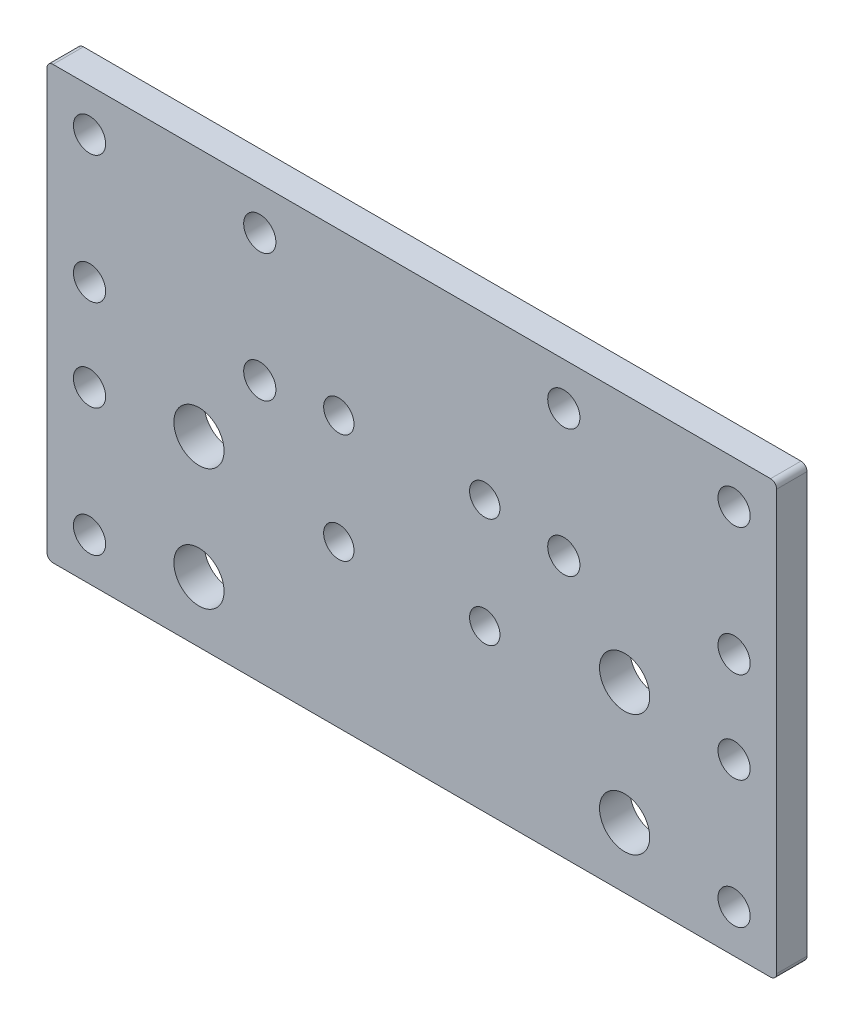
ISO-10303-21;
HEADER;
FILE_DESCRIPTION(('STEP AP214'),'2;1');
FILE_NAME('part.step','',(''),(''),'','','');
FILE_SCHEMA(('AUTOMOTIVE_DESIGN { 1 0 10303 214 1 1 1 1 }'));
ENDSEC;
DATA;
#1=APPLICATION_CONTEXT('core data for automotive mechanical design processes');
#2=APPLICATION_PROTOCOL_DEFINITION('international standard','automotive_design',2000,#1);
#3=PRODUCT_CONTEXT('',#1,'mechanical');
#4=PRODUCT('Part','Part','',(#3));
#5=PRODUCT_RELATED_PRODUCT_CATEGORY('part','',(#4));
#6=PRODUCT_DEFINITION_FORMATION('','',#4);
#7=PRODUCT_DEFINITION_CONTEXT('part definition',#1,'design');
#8=PRODUCT_DEFINITION('design','',#6,#7);
#9=PRODUCT_DEFINITION_SHAPE('','',#8);
#10=(LENGTH_UNIT() NAMED_UNIT(*) SI_UNIT(.MILLI.,.METRE.));
#11=(NAMED_UNIT(*) PLANE_ANGLE_UNIT() SI_UNIT($,.RADIAN.));
#12=(NAMED_UNIT(*) SI_UNIT($,.STERADIAN.) SOLID_ANGLE_UNIT());
#13=UNCERTAINTY_MEASURE_WITH_UNIT(LENGTH_MEASURE(1.E-05),#10,'distance_accuracy_value','');
#14=(GEOMETRIC_REPRESENTATION_CONTEXT(3) GLOBAL_UNCERTAINTY_ASSIGNED_CONTEXT((#13)) GLOBAL_UNIT_ASSIGNED_CONTEXT((#10,
#11,#12)) REPRESENTATION_CONTEXT('',''));
#15=CARTESIAN_POINT('',(0.,0.,0.));
#16=DIRECTION('',(0.,0.,1.));
#17=DIRECTION('',(1.,0.,0.));
#18=AXIS2_PLACEMENT_3D('',#15,#16,#17);
#19=CARTESIAN_POINT('',(0.,0.,5.));
#20=DIRECTION('',(0.,0.,-1.));
#21=DIRECTION('',(-1.,0.,0.));
#22=AXIS2_PLACEMENT_3D('',#19,#20,#21);
#23=PLANE('',#22);
#24=CARTESIAN_POINT('',(113.000000000018,7.00000000000894,5.));
#25=DIRECTION('',(0.,0.,-1.));
#26=DIRECTION('',(-1.,0.,0.));
#27=AXIS2_PLACEMENT_3D('',#24,#25,#26);
#28=CIRCLE('',#27,2.65000000001325);
#29=CARTESIAN_POINT('',(110.350000000005,7.00000000000894,5.));
#30=VERTEX_POINT('',#29);
#31=EDGE_CURVE('E233',#30,#30,#28,.T.);
#32=ORIENTED_EDGE('',*,*,#31,.T.);
#33=EDGE_LOOP('',(#32));
#34=FACE_BOUND('',#33,.T.);
#35=CARTESIAN_POINT('',(24.9999999999999,10.0000000000001,5.));
#36=DIRECTION('',(0.,0.,-1.));
#37=DIRECTION('',(-1.,0.,0.));
#38=AXIS2_PLACEMENT_3D('',#35,#36,#37);
#39=CIRCLE('',#38,4.1275);
#40=CARTESIAN_POINT('',(20.8724999999999,10.0000000000001,5.));
#41=VERTEX_POINT('',#40);
#42=EDGE_CURVE('E221',#41,#41,#39,.T.);
#43=ORIENTED_EDGE('',*,*,#42,.T.);
#44=EDGE_LOOP('',(#43));
#45=FACE_BOUND('',#44,.T.);
#46=CARTESIAN_POINT('',(113.000000000018,28.0000000000089,5.));
#47=DIRECTION('',(0.,0.,-1.));
#48=DIRECTION('',(-1.,0.,0.));
#49=AXIS2_PLACEMENT_3D('',#46,#47,#48);
#50=CIRCLE('',#49,2.65000000001325);
#51=CARTESIAN_POINT('',(110.350000000005,28.0000000000089,5.));
#52=VERTEX_POINT('',#51);
#53=EDGE_CURVE('E218',#52,#52,#50,.T.);
#54=ORIENTED_EDGE('',*,*,#53,.T.);
#55=EDGE_LOOP('',(#54));
#56=FACE_BOUND('',#55,.T.);
#57=CARTESIAN_POINT('',(85.0000000000015,43.0000000000007,5.));
#58=DIRECTION('',(0.,0.,-1.));
#59=DIRECTION('',(-1.,0.,0.));
#60=AXIS2_PLACEMENT_3D('',#57,#58,#59);
#61=CIRCLE('',#60,2.65);
#62=CARTESIAN_POINT('',(82.3500000000015,43.0000000000007,5.));
#63=VERTEX_POINT('',#62);
#64=EDGE_CURVE('E215',#63,#63,#61,.T.);
#65=ORIENTED_EDGE('',*,*,#64,.T.);
#66=EDGE_LOOP('',(#65));
#67=FACE_BOUND('',#66,.T.);
#68=CARTESIAN_POINT('',(24.9999999999998,30.,5.));
#69=DIRECTION('',(0.,0.,-1.));
#70=DIRECTION('',(-1.,0.,0.));
#71=AXIS2_PLACEMENT_3D('',#68,#69,#70);
#72=CIRCLE('',#71,4.12749999999999);
#73=CARTESIAN_POINT('',(20.8724999999998,30.,5.));
#74=VERTEX_POINT('',#73);
#75=EDGE_CURVE('E211',#74,#74,#72,.T.);
#76=ORIENTED_EDGE('',*,*,#75,.T.);
#77=EDGE_LOOP('',(#76));
#78=FACE_BOUND('',#77,.T.);
#79=CARTESIAN_POINT('',(35.,43.,5.));
#80=DIRECTION('',(0.,0.,-1.));
#81=DIRECTION('',(-1.,0.,0.));
#82=AXIS2_PLACEMENT_3D('',#79,#80,#81);
#83=CIRCLE('',#82,2.65);
#84=CARTESIAN_POINT('',(32.35,43.,5.));
#85=VERTEX_POINT('',#84);
#86=EDGE_CURVE('E207',#85,#85,#83,.T.);
#87=ORIENTED_EDGE('',*,*,#86,.T.);
#88=EDGE_LOOP('',(#87));
#89=FACE_BOUND('',#88,.T.);
#90=CARTESIAN_POINT('',(85.0000000000179,64.0000000000089,5.));
#91=DIRECTION('',(0.,0.,-1.));
#92=DIRECTION('',(-1.,0.,0.));
#93=AXIS2_PLACEMENT_3D('',#90,#91,#92);
#94=CIRCLE('',#93,2.65000000001322);
#95=CARTESIAN_POINT('',(82.3500000000047,64.0000000000089,5.));
#96=VERTEX_POINT('',#95);
#97=EDGE_CURVE('E203',#96,#96,#94,.T.);
#98=ORIENTED_EDGE('',*,*,#97,.T.);
#99=EDGE_LOOP('',(#98));
#100=FACE_BOUND('',#99,.T.);
#101=CARTESIAN_POINT('',(113.000000000018,43.0000000000089,5.));
#102=DIRECTION('',(0.,0.,-1.));
#103=DIRECTION('',(-1.,0.,0.));
#104=AXIS2_PLACEMENT_3D('',#101,#102,#103);
#105=CIRCLE('',#104,2.65000000001323);
#106=CARTESIAN_POINT('',(110.350000000005,43.0000000000089,5.));
#107=VERTEX_POINT('',#106);
#108=EDGE_CURVE('E199',#107,#107,#105,.T.);
#109=ORIENTED_EDGE('',*,*,#108,.T.);
#110=EDGE_LOOP('',(#109));
#111=FACE_BOUND('',#110,.T.);
#112=CARTESIAN_POINT('',(7.00000000000002,7.00000000000003,5.));
#113=DIRECTION('',(0.,0.,-1.));
#114=DIRECTION('',(-1.,0.,0.));
#115=AXIS2_PLACEMENT_3D('',#112,#113,#114);
#116=CIRCLE('',#115,2.65);
#117=CARTESIAN_POINT('',(4.35000000000002,7.00000000000003,5.));
#118=VERTEX_POINT('',#117);
#119=EDGE_CURVE('E195',#118,#118,#116,.T.);
#120=ORIENTED_EDGE('',*,*,#119,.T.);
#121=EDGE_LOOP('',(#120));
#122=FACE_BOUND('',#121,.T.);
#123=CARTESIAN_POINT('',(94.9999999999999,10.,5.));
#124=DIRECTION('',(0.,0.,-1.));
#125=DIRECTION('',(-1.,0.,0.));
#126=AXIS2_PLACEMENT_3D('',#123,#124,#125);
#127=CIRCLE('',#126,4.12749999999999);
#128=CARTESIAN_POINT('',(90.8724999999999,10.,5.));
#129=VERTEX_POINT('',#128);
#130=EDGE_CURVE('E191',#129,#129,#127,.T.);
#131=ORIENTED_EDGE('',*,*,#130,.T.);
#132=EDGE_LOOP('',(#131));
#133=FACE_BOUND('',#132,.T.);
#134=CARTESIAN_POINT('',(94.9999999999999,30.,5.));
#135=DIRECTION('',(0.,0.,-1.));
#136=DIRECTION('',(-1.,0.,0.));
#137=AXIS2_PLACEMENT_3D('',#134,#135,#136);
#138=CIRCLE('',#137,4.12749999999999);
#139=CARTESIAN_POINT('',(90.8725,30.,5.));
#140=VERTEX_POINT('',#139);
#141=EDGE_CURVE('E187',#140,#140,#138,.T.);
#142=ORIENTED_EDGE('',*,*,#141,.T.);
#143=EDGE_LOOP('',(#142));
#144=FACE_BOUND('',#143,.T.);
#145=CARTESIAN_POINT('',(7.00000000000002,28.,5.));
#146=DIRECTION('',(0.,0.,-1.));
#147=DIRECTION('',(-1.,0.,0.));
#148=AXIS2_PLACEMENT_3D('',#145,#146,#147);
#149=CIRCLE('',#148,2.65);
#150=CARTESIAN_POINT('',(4.35000000000002,28.,5.));
#151=VERTEX_POINT('',#150);
#152=EDGE_CURVE('E183',#151,#151,#149,.T.);
#153=ORIENTED_EDGE('',*,*,#152,.T.);
#154=EDGE_LOOP('',(#153));
#155=FACE_BOUND('',#154,.T.);
#156=CARTESIAN_POINT('',(7.00000000000002,64.,5.));
#157=DIRECTION('',(0.,0.,-1.));
#158=DIRECTION('',(-1.,0.,0.));
#159=AXIS2_PLACEMENT_3D('',#156,#157,#158);
#160=CIRCLE('',#159,2.65);
#161=CARTESIAN_POINT('',(4.35000000000002,64.,5.));
#162=VERTEX_POINT('',#161);
#163=EDGE_CURVE('E179',#162,#162,#160,.T.);
#164=ORIENTED_EDGE('',*,*,#163,.T.);
#165=EDGE_LOOP('',(#164));
#166=FACE_BOUND('',#165,.T.);
#167=CARTESIAN_POINT('',(7.00000000000002,43.,5.));
#168=DIRECTION('',(0.,0.,-1.));
#169=DIRECTION('',(-1.,0.,0.));
#170=AXIS2_PLACEMENT_3D('',#167,#168,#169);
#171=CIRCLE('',#170,2.65);
#172=CARTESIAN_POINT('',(4.35000000000002,43.,5.));
#173=VERTEX_POINT('',#172);
#174=EDGE_CURVE('E175',#173,#173,#171,.T.);
#175=ORIENTED_EDGE('',*,*,#174,.T.);
#176=EDGE_LOOP('',(#175));
#177=FACE_BOUND('',#176,.T.);
#178=CARTESIAN_POINT('',(35.,64.,5.));
#179=DIRECTION('',(0.,0.,-1.));
#180=DIRECTION('',(-1.,0.,0.));
#181=AXIS2_PLACEMENT_3D('',#178,#179,#180);
#182=CIRCLE('',#181,2.65);
#183=CARTESIAN_POINT('',(32.35,64.,5.));
#184=VERTEX_POINT('',#183);
#185=EDGE_CURVE('E171',#184,#184,#182,.T.);
#186=ORIENTED_EDGE('',*,*,#185,.T.);
#187=EDGE_LOOP('',(#186));
#188=FACE_BOUND('',#187,.T.);
#189=CARTESIAN_POINT('',(113.000000000018,64.0000000000089,5.));
#190=DIRECTION('',(0.,0.,-1.));
#191=DIRECTION('',(-1.,0.,0.));
#192=AXIS2_PLACEMENT_3D('',#189,#190,#191);
#193=CIRCLE('',#192,2.65000000001322);
#194=CARTESIAN_POINT('',(110.350000000005,64.0000000000089,5.));
#195=VERTEX_POINT('',#194);
#196=EDGE_CURVE('E167',#195,#195,#193,.T.);
#197=ORIENTED_EDGE('',*,*,#196,.T.);
#198=EDGE_LOOP('',(#197));
#199=FACE_BOUND('',#198,.T.);
#200=DIRECTION('',(0.,-1.,0.));
#201=VECTOR('',#200,1.);
#202=CARTESIAN_POINT('',(0.,0.,5.));
#203=LINE('',#202,#201);
#204=CARTESIAN_POINT('',(0.,70.,5.));
#205=VERTEX_POINT('',#204);
#206=CARTESIAN_POINT('',(0.,1.,5.));
#207=VERTEX_POINT('',#206);
#208=EDGE_CURVE('E141',#205,#207,#203,.T.);
#209=ORIENTED_EDGE('',*,*,#208,.T.);
#210=CARTESIAN_POINT('',(1.,1.,5.));
#211=DIRECTION('',(0.,0.,-1.));
#212=DIRECTION('',(-1.,0.,0.));
#213=AXIS2_PLACEMENT_3D('',#210,#211,#212);
#214=CIRCLE('',#213,1.);
#215=CARTESIAN_POINT('',(1.,0.,5.));
#216=VERTEX_POINT('',#215);
#217=EDGE_CURVE('E156',#207,#216,#214,.F.);
#218=ORIENTED_EDGE('',*,*,#217,.T.);
#219=DIRECTION('',(1.,0.,0.));
#220=VECTOR('',#219,1.);
#221=CARTESIAN_POINT('',(0.,0.,5.));
#222=LINE('',#221,#220);
#223=CARTESIAN_POINT('',(119.,0.,5.));
#224=VERTEX_POINT('',#223);
#225=EDGE_CURVE('E123',#216,#224,#222,.T.);
#226=ORIENTED_EDGE('',*,*,#225,.T.);
#227=CARTESIAN_POINT('',(119.,1.,5.));
#228=DIRECTION('',(0.,0.,-1.));
#229=DIRECTION('',(-1.,0.,0.));
#230=AXIS2_PLACEMENT_3D('',#227,#228,#229);
#231=CIRCLE('',#230,1.);
#232=CARTESIAN_POINT('',(120.,1.,5.));
#233=VERTEX_POINT('',#232);
#234=EDGE_CURVE('E154',#224,#233,#231,.F.);
#235=ORIENTED_EDGE('',*,*,#234,.T.);
#236=DIRECTION('',(0.,1.,0.));
#237=VECTOR('',#236,1.);
#238=CARTESIAN_POINT('',(120.,0.,5.));
#239=LINE('',#238,#237);
#240=CARTESIAN_POINT('',(120.,70.,5.));
#241=VERTEX_POINT('',#240);
#242=EDGE_CURVE('E262',#233,#241,#239,.T.);
#243=ORIENTED_EDGE('',*,*,#242,.T.);
#244=CARTESIAN_POINT('',(119.,70.,5.));
#245=DIRECTION('',(0.,0.,-1.));
#246=DIRECTION('',(-1.,0.,0.));
#247=AXIS2_PLACEMENT_3D('',#244,#245,#246);
#248=CIRCLE('',#247,1.);
#249=CARTESIAN_POINT('',(119.,71.,5.));
#250=VERTEX_POINT('',#249);
#251=EDGE_CURVE('E58',#241,#250,#248,.F.);
#252=ORIENTED_EDGE('',*,*,#251,.T.);
#253=DIRECTION('',(-1.,0.,0.));
#254=VECTOR('',#253,1.);
#255=CARTESIAN_POINT('',(0.,71.,5.));
#256=LINE('',#255,#254);
#257=CARTESIAN_POINT('',(1.,71.,5.));
#258=VERTEX_POINT('',#257);
#259=EDGE_CURVE('E142',#250,#258,#256,.T.);
#260=ORIENTED_EDGE('',*,*,#259,.T.);
#261=CARTESIAN_POINT('',(1.,70.,5.));
#262=DIRECTION('',(0.,0.,-1.));
#263=DIRECTION('',(-1.,0.,0.));
#264=AXIS2_PLACEMENT_3D('',#261,#262,#263);
#265=CIRCLE('',#264,1.);
#266=EDGE_CURVE('E151',#258,#205,#265,.F.);
#267=ORIENTED_EDGE('',*,*,#266,.T.);
#268=EDGE_LOOP('',(#209,#218,#226,#235,#243,#252,#260,#267));
#269=FACE_BOUND('',#268,.T.);
#270=CARTESIAN_POINT('',(48.,44.5,5.));
#271=DIRECTION('',(0.,0.,1.));
#272=DIRECTION('',(1.,0.,0.));
#273=AXIS2_PLACEMENT_3D('',#270,#271,#272);
#274=CIRCLE('',#273,2.5);
#275=CARTESIAN_POINT('',(50.5,44.5,5.));
#276=VERTEX_POINT('',#275);
#277=EDGE_CURVE('E136',#276,#276,#274,.T.);
#278=ORIENTED_EDGE('',*,*,#277,.F.);
#279=EDGE_LOOP('',(#278));
#280=FACE_BOUND('',#279,.T.);
#281=CARTESIAN_POINT('',(72.,44.5,5.));
#282=DIRECTION('',(0.,0.,1.));
#283=DIRECTION('',(1.,0.,0.));
#284=AXIS2_PLACEMENT_3D('',#281,#282,#283);
#285=CIRCLE('',#284,2.5);
#286=CARTESIAN_POINT('',(74.5,44.5,5.));
#287=VERTEX_POINT('',#286);
#288=EDGE_CURVE('E249',#287,#287,#285,.T.);
#289=ORIENTED_EDGE('',*,*,#288,.F.);
#290=EDGE_LOOP('',(#289));
#291=FACE_BOUND('',#290,.T.);
#292=CARTESIAN_POINT('',(48.,26.5,5.));
#293=DIRECTION('',(0.,0.,1.));
#294=DIRECTION('',(1.,0.,0.));
#295=AXIS2_PLACEMENT_3D('',#292,#293,#294);
#296=CIRCLE('',#295,2.5);
#297=CARTESIAN_POINT('',(50.5,26.5,5.));
#298=VERTEX_POINT('',#297);
#299=EDGE_CURVE('E243',#298,#298,#296,.T.);
#300=ORIENTED_EDGE('',*,*,#299,.F.);
#301=EDGE_LOOP('',(#300));
#302=FACE_BOUND('',#301,.T.);
#303=CARTESIAN_POINT('',(72.,26.5,5.));
#304=DIRECTION('',(0.,0.,1.));
#305=DIRECTION('',(1.,0.,0.));
#306=AXIS2_PLACEMENT_3D('',#303,#304,#305);
#307=CIRCLE('',#306,2.49999999999999);
#308=CARTESIAN_POINT('',(74.5,26.5,5.));
#309=VERTEX_POINT('',#308);
#310=EDGE_CURVE('E237',#309,#309,#307,.T.);
#311=ORIENTED_EDGE('',*,*,#310,.F.);
#312=EDGE_LOOP('',(#311));
#313=FACE_BOUND('',#312,.T.);
#314=ADVANCED_FACE('F35',(#34,#45,#56,#67,#78,#89,#100,#111,#122,#133,#144,#155,#166,#177,#188,
#199,#269,#280,#291,#302,#313),#23,.F.);
#315=CARTESIAN_POINT('',(0.,0.,0.));
#316=DIRECTION('',(0.,0.,-1.));
#317=DIRECTION('',(-1.,0.,0.));
#318=AXIS2_PLACEMENT_3D('',#315,#316,#317);
#319=PLANE('',#318);
#320=CARTESIAN_POINT('',(113.000000000018,7.00000000000894,0.));
#321=DIRECTION('',(0.,0.,-1.));
#322=DIRECTION('',(-1.,0.,0.));
#323=AXIS2_PLACEMENT_3D('',#320,#321,#322);
#324=CIRCLE('',#323,2.65000000001325);
#325=CARTESIAN_POINT('',(110.350000000005,7.00000000000894,0.));
#326=VERTEX_POINT('',#325);
#327=EDGE_CURVE('E39',#326,#326,#324,.T.);
#328=ORIENTED_EDGE('',*,*,#327,.F.);
#329=EDGE_LOOP('',(#328));
#330=FACE_BOUND('',#329,.T.);
#331=CARTESIAN_POINT('',(24.9999999999999,10.0000000000001,0.));
#332=DIRECTION('',(0.,0.,-1.));
#333=DIRECTION('',(-1.,0.,0.));
#334=AXIS2_PLACEMENT_3D('',#331,#332,#333);
#335=CIRCLE('',#334,4.1275);
#336=CARTESIAN_POINT('',(20.8724999999999,10.0000000000001,0.));
#337=VERTEX_POINT('',#336);
#338=EDGE_CURVE('E219',#337,#337,#335,.T.);
#339=ORIENTED_EDGE('',*,*,#338,.F.);
#340=EDGE_LOOP('',(#339));
#341=FACE_BOUND('',#340,.T.);
#342=CARTESIAN_POINT('',(113.000000000018,28.0000000000089,0.));
#343=DIRECTION('',(0.,0.,-1.));
#344=DIRECTION('',(-1.,0.,0.));
#345=AXIS2_PLACEMENT_3D('',#342,#343,#344);
#346=CIRCLE('',#345,2.65000000001325);
#347=CARTESIAN_POINT('',(110.350000000005,28.0000000000089,0.));
#348=VERTEX_POINT('',#347);
#349=EDGE_CURVE('E216',#348,#348,#346,.T.);
#350=ORIENTED_EDGE('',*,*,#349,.F.);
#351=EDGE_LOOP('',(#350));
#352=FACE_BOUND('',#351,.T.);
#353=CARTESIAN_POINT('',(85.0000000000015,43.0000000000007,0.));
#354=DIRECTION('',(0.,0.,-1.));
#355=DIRECTION('',(-1.,0.,0.));
#356=AXIS2_PLACEMENT_3D('',#353,#354,#355);
#357=CIRCLE('',#356,2.65);
#358=CARTESIAN_POINT('',(82.3500000000015,43.0000000000007,0.));
#359=VERTEX_POINT('',#358);
#360=EDGE_CURVE('E212',#359,#359,#357,.T.);
#361=ORIENTED_EDGE('',*,*,#360,.F.);
#362=EDGE_LOOP('',(#361));
#363=FACE_BOUND('',#362,.T.);
#364=CARTESIAN_POINT('',(24.9999999999998,30.,0.));
#365=DIRECTION('',(0.,0.,-1.));
#366=DIRECTION('',(-1.,0.,0.));
#367=AXIS2_PLACEMENT_3D('',#364,#365,#366);
#368=CIRCLE('',#367,4.12749999999999);
#369=CARTESIAN_POINT('',(20.8724999999998,30.,0.));
#370=VERTEX_POINT('',#369);
#371=EDGE_CURVE('E208',#370,#370,#368,.T.);
#372=ORIENTED_EDGE('',*,*,#371,.F.);
#373=EDGE_LOOP('',(#372));
#374=FACE_BOUND('',#373,.T.);
#375=CARTESIAN_POINT('',(35.,43.,0.));
#376=DIRECTION('',(0.,0.,-1.));
#377=DIRECTION('',(-1.,0.,0.));
#378=AXIS2_PLACEMENT_3D('',#375,#376,#377);
#379=CIRCLE('',#378,2.65);
#380=CARTESIAN_POINT('',(32.35,43.,0.));
#381=VERTEX_POINT('',#380);
#382=EDGE_CURVE('E204',#381,#381,#379,.T.);
#383=ORIENTED_EDGE('',*,*,#382,.F.);
#384=EDGE_LOOP('',(#383));
#385=FACE_BOUND('',#384,.T.);
#386=CARTESIAN_POINT('',(85.0000000000179,64.0000000000089,0.));
#387=DIRECTION('',(0.,0.,-1.));
#388=DIRECTION('',(-1.,0.,0.));
#389=AXIS2_PLACEMENT_3D('',#386,#387,#388);
#390=CIRCLE('',#389,2.65000000001322);
#391=CARTESIAN_POINT('',(82.3500000000047,64.0000000000089,0.));
#392=VERTEX_POINT('',#391);
#393=EDGE_CURVE('E200',#392,#392,#390,.T.);
#394=ORIENTED_EDGE('',*,*,#393,.F.);
#395=EDGE_LOOP('',(#394));
#396=FACE_BOUND('',#395,.T.);
#397=CARTESIAN_POINT('',(113.000000000018,43.0000000000089,0.));
#398=DIRECTION('',(0.,0.,-1.));
#399=DIRECTION('',(-1.,0.,0.));
#400=AXIS2_PLACEMENT_3D('',#397,#398,#399);
#401=CIRCLE('',#400,2.65000000001323);
#402=CARTESIAN_POINT('',(110.350000000005,43.0000000000089,0.));
#403=VERTEX_POINT('',#402);
#404=EDGE_CURVE('E196',#403,#403,#401,.T.);
#405=ORIENTED_EDGE('',*,*,#404,.F.);
#406=EDGE_LOOP('',(#405));
#407=FACE_BOUND('',#406,.T.);
#408=CARTESIAN_POINT('',(7.00000000000002,7.00000000000003,0.));
#409=DIRECTION('',(0.,0.,-1.));
#410=DIRECTION('',(-1.,0.,0.));
#411=AXIS2_PLACEMENT_3D('',#408,#409,#410);
#412=CIRCLE('',#411,2.65);
#413=CARTESIAN_POINT('',(4.35000000000002,7.00000000000003,0.));
#414=VERTEX_POINT('',#413);
#415=EDGE_CURVE('E192',#414,#414,#412,.T.);
#416=ORIENTED_EDGE('',*,*,#415,.F.);
#417=EDGE_LOOP('',(#416));
#418=FACE_BOUND('',#417,.T.);
#419=CARTESIAN_POINT('',(94.9999999999999,10.,0.));
#420=DIRECTION('',(0.,0.,-1.));
#421=DIRECTION('',(-1.,0.,0.));
#422=AXIS2_PLACEMENT_3D('',#419,#420,#421);
#423=CIRCLE('',#422,4.12749999999999);
#424=CARTESIAN_POINT('',(90.8724999999999,10.,0.));
#425=VERTEX_POINT('',#424);
#426=EDGE_CURVE('E188',#425,#425,#423,.T.);
#427=ORIENTED_EDGE('',*,*,#426,.F.);
#428=EDGE_LOOP('',(#427));
#429=FACE_BOUND('',#428,.T.);
#430=CARTESIAN_POINT('',(94.9999999999999,30.,0.));
#431=DIRECTION('',(0.,0.,-1.));
#432=DIRECTION('',(-1.,0.,0.));
#433=AXIS2_PLACEMENT_3D('',#430,#431,#432);
#434=CIRCLE('',#433,4.12749999999999);
#435=CARTESIAN_POINT('',(90.8725,30.,0.));
#436=VERTEX_POINT('',#435);
#437=EDGE_CURVE('E184',#436,#436,#434,.T.);
#438=ORIENTED_EDGE('',*,*,#437,.F.);
#439=EDGE_LOOP('',(#438));
#440=FACE_BOUND('',#439,.T.);
#441=CARTESIAN_POINT('',(7.00000000000002,28.,0.));
#442=DIRECTION('',(0.,0.,-1.));
#443=DIRECTION('',(-1.,0.,0.));
#444=AXIS2_PLACEMENT_3D('',#441,#442,#443);
#445=CIRCLE('',#444,2.65);
#446=CARTESIAN_POINT('',(4.35000000000002,28.,0.));
#447=VERTEX_POINT('',#446);
#448=EDGE_CURVE('E180',#447,#447,#445,.T.);
#449=ORIENTED_EDGE('',*,*,#448,.F.);
#450=EDGE_LOOP('',(#449));
#451=FACE_BOUND('',#450,.T.);
#452=CARTESIAN_POINT('',(7.00000000000002,64.,0.));
#453=DIRECTION('',(0.,0.,-1.));
#454=DIRECTION('',(-1.,0.,0.));
#455=AXIS2_PLACEMENT_3D('',#452,#453,#454);
#456=CIRCLE('',#455,2.65);
#457=CARTESIAN_POINT('',(4.35000000000002,64.,0.));
#458=VERTEX_POINT('',#457);
#459=EDGE_CURVE('E176',#458,#458,#456,.T.);
#460=ORIENTED_EDGE('',*,*,#459,.F.);
#461=EDGE_LOOP('',(#460));
#462=FACE_BOUND('',#461,.T.);
#463=CARTESIAN_POINT('',(7.00000000000002,43.,0.));
#464=DIRECTION('',(0.,0.,-1.));
#465=DIRECTION('',(-1.,0.,0.));
#466=AXIS2_PLACEMENT_3D('',#463,#464,#465);
#467=CIRCLE('',#466,2.65);
#468=CARTESIAN_POINT('',(4.35000000000002,43.,0.));
#469=VERTEX_POINT('',#468);
#470=EDGE_CURVE('E172',#469,#469,#467,.T.);
#471=ORIENTED_EDGE('',*,*,#470,.F.);
#472=EDGE_LOOP('',(#471));
#473=FACE_BOUND('',#472,.T.);
#474=CARTESIAN_POINT('',(35.,64.,0.));
#475=DIRECTION('',(0.,0.,-1.));
#476=DIRECTION('',(-1.,0.,0.));
#477=AXIS2_PLACEMENT_3D('',#474,#475,#476);
#478=CIRCLE('',#477,2.65);
#479=CARTESIAN_POINT('',(32.35,64.,0.));
#480=VERTEX_POINT('',#479);
#481=EDGE_CURVE('E168',#480,#480,#478,.T.);
#482=ORIENTED_EDGE('',*,*,#481,.F.);
#483=EDGE_LOOP('',(#482));
#484=FACE_BOUND('',#483,.T.);
#485=CARTESIAN_POINT('',(113.000000000018,64.0000000000089,0.));
#486=DIRECTION('',(0.,0.,-1.));
#487=DIRECTION('',(-1.,0.,0.));
#488=AXIS2_PLACEMENT_3D('',#485,#486,#487);
#489=CIRCLE('',#488,2.65000000001322);
#490=CARTESIAN_POINT('',(110.350000000005,64.0000000000089,0.));
#491=VERTEX_POINT('',#490);
#492=EDGE_CURVE('E164',#491,#491,#489,.T.);
#493=ORIENTED_EDGE('',*,*,#492,.F.);
#494=EDGE_LOOP('',(#493));
#495=FACE_BOUND('',#494,.T.);
#496=CARTESIAN_POINT('',(48.,26.5,0.));
#497=DIRECTION('',(0.,0.,1.));
#498=DIRECTION('',(1.,0.,0.));
#499=AXIS2_PLACEMENT_3D('',#496,#497,#498);
#500=CIRCLE('',#499,2.5);
#501=CARTESIAN_POINT('',(50.5,26.5,0.));
#502=VERTEX_POINT('',#501);
#503=EDGE_CURVE('E240',#502,#502,#500,.T.);
#504=ORIENTED_EDGE('',*,*,#503,.T.);
#505=EDGE_LOOP('',(#504));
#506=FACE_BOUND('',#505,.T.);
#507=CARTESIAN_POINT('',(48.,44.5,0.));
#508=DIRECTION('',(0.,0.,1.));
#509=DIRECTION('',(1.,0.,0.));
#510=AXIS2_PLACEMENT_3D('',#507,#508,#509);
#511=CIRCLE('',#510,2.5);
#512=CARTESIAN_POINT('',(50.5,44.5,0.));
#513=VERTEX_POINT('',#512);
#514=EDGE_CURVE('E252',#513,#513,#511,.T.);
#515=ORIENTED_EDGE('',*,*,#514,.T.);
#516=EDGE_LOOP('',(#515));
#517=FACE_BOUND('',#516,.T.);
#518=DIRECTION('',(1.,0.,0.));
#519=VECTOR('',#518,1.);
#520=CARTESIAN_POINT('',(0.,0.,0.));
#521=LINE('',#520,#519);
#522=CARTESIAN_POINT('',(1.,0.,0.));
#523=VERTEX_POINT('',#522);
#524=CARTESIAN_POINT('',(119.,0.,0.));
#525=VERTEX_POINT('',#524);
#526=EDGE_CURVE('E120',#523,#525,#521,.T.);
#527=ORIENTED_EDGE('',*,*,#526,.F.);
#528=CARTESIAN_POINT('',(1.,1.,0.));
#529=DIRECTION('',(0.,0.,-1.));
#530=DIRECTION('',(-1.,0.,0.));
#531=AXIS2_PLACEMENT_3D('',#528,#529,#530);
#532=CIRCLE('',#531,1.);
#533=CARTESIAN_POINT('',(0.,1.,0.));
#534=VERTEX_POINT('',#533);
#535=EDGE_CURVE('E103',#523,#534,#532,.T.);
#536=ORIENTED_EDGE('',*,*,#535,.T.);
#537=DIRECTION('',(0.,-1.,0.));
#538=VECTOR('',#537,1.);
#539=CARTESIAN_POINT('',(0.,0.,0.));
#540=LINE('',#539,#538);
#541=CARTESIAN_POINT('',(0.,70.,0.));
#542=VERTEX_POINT('',#541);
#543=EDGE_CURVE('E131',#542,#534,#540,.T.);
#544=ORIENTED_EDGE('',*,*,#543,.F.);
#545=CARTESIAN_POINT('',(1.,70.,0.));
#546=DIRECTION('',(0.,0.,-1.));
#547=DIRECTION('',(-1.,0.,0.));
#548=AXIS2_PLACEMENT_3D('',#545,#546,#547);
#549=CIRCLE('',#548,1.);
#550=CARTESIAN_POINT('',(1.,71.,0.));
#551=VERTEX_POINT('',#550);
#552=EDGE_CURVE('E124',#542,#551,#549,.T.);
#553=ORIENTED_EDGE('',*,*,#552,.T.);
#554=DIRECTION('',(-1.,0.,0.));
#555=VECTOR('',#554,1.);
#556=CARTESIAN_POINT('',(0.,71.,0.));
#557=LINE('',#556,#555);
#558=CARTESIAN_POINT('',(119.,71.,0.));
#559=VERTEX_POINT('',#558);
#560=EDGE_CURVE('E134',#559,#551,#557,.T.);
#561=ORIENTED_EDGE('',*,*,#560,.F.);
#562=CARTESIAN_POINT('',(119.,70.,0.));
#563=DIRECTION('',(0.,0.,-1.));
#564=DIRECTION('',(-1.,0.,0.));
#565=AXIS2_PLACEMENT_3D('',#562,#563,#564);
#566=CIRCLE('',#565,1.);
#567=CARTESIAN_POINT('',(120.,70.,0.));
#568=VERTEX_POINT('',#567);
#569=EDGE_CURVE('E145',#559,#568,#566,.T.);
#570=ORIENTED_EDGE('',*,*,#569,.T.);
#571=DIRECTION('',(0.,1.,0.));
#572=VECTOR('',#571,1.);
#573=CARTESIAN_POINT('',(120.,0.,0.));
#574=LINE('',#573,#572);
#575=CARTESIAN_POINT('',(120.,1.,0.));
#576=VERTEX_POINT('',#575);
#577=EDGE_CURVE('E130',#576,#568,#574,.T.);
#578=ORIENTED_EDGE('',*,*,#577,.F.);
#579=CARTESIAN_POINT('',(119.,1.,0.));
#580=DIRECTION('',(0.,0.,-1.));
#581=DIRECTION('',(-1.,0.,0.));
#582=AXIS2_PLACEMENT_3D('',#579,#580,#581);
#583=CIRCLE('',#582,1.);
#584=EDGE_CURVE('E114',#576,#525,#583,.T.);
#585=ORIENTED_EDGE('',*,*,#584,.T.);
#586=EDGE_LOOP('',(#527,#536,#544,#553,#561,#570,#578,#585));
#587=FACE_BOUND('',#586,.T.);
#588=CARTESIAN_POINT('',(72.,44.5,0.));
#589=DIRECTION('',(0.,0.,1.));
#590=DIRECTION('',(1.,0.,0.));
#591=AXIS2_PLACEMENT_3D('',#588,#589,#590);
#592=CIRCLE('',#591,2.5);
#593=CARTESIAN_POINT('',(74.5,44.5,0.));
#594=VERTEX_POINT('',#593);
#595=EDGE_CURVE('E246',#594,#594,#592,.T.);
#596=ORIENTED_EDGE('',*,*,#595,.T.);
#597=EDGE_LOOP('',(#596));
#598=FACE_BOUND('',#597,.T.);
#599=CARTESIAN_POINT('',(72.,26.5,0.));
#600=DIRECTION('',(0.,0.,1.));
#601=DIRECTION('',(1.,0.,0.));
#602=AXIS2_PLACEMENT_3D('',#599,#600,#601);
#603=CIRCLE('',#602,2.49999999999999);
#604=CARTESIAN_POINT('',(74.5,26.5,0.));
#605=VERTEX_POINT('',#604);
#606=EDGE_CURVE('E236',#605,#605,#603,.T.);
#607=ORIENTED_EDGE('',*,*,#606,.T.);
#608=EDGE_LOOP('',(#607));
#609=FACE_BOUND('',#608,.T.);
#610=ADVANCED_FACE('F127',(#330,#341,#352,#363,#374,#385,#396,#407,#418,#429,#440,#451,#462,
#473,#484,#495,#506,#517,#587,#598,#609),#319,.T.);
#611=CARTESIAN_POINT('',(0.,0.,5.));
#612=DIRECTION('',(1.,0.,0.));
#613=DIRECTION('',(0.,0.,-1.));
#614=AXIS2_PLACEMENT_3D('',#611,#612,#613);
#615=PLANE('',#614);
#616=ORIENTED_EDGE('',*,*,#543,.T.);
#617=DIRECTION('',(0.,0.,-1.));
#618=VECTOR('',#617,1.);
#619=CARTESIAN_POINT('',(0.,1.,5.));
#620=LINE('',#619,#618);
#621=EDGE_CURVE('E108',#534,#207,#620,.F.);
#622=ORIENTED_EDGE('',*,*,#621,.T.);
#623=ORIENTED_EDGE('',*,*,#208,.F.);
#624=DIRECTION('',(0.,0.,-1.));
#625=VECTOR('',#624,1.);
#626=CARTESIAN_POINT('',(0.,70.,5.));
#627=LINE('',#626,#625);
#628=EDGE_CURVE('E113',#205,#542,#627,.T.);
#629=ORIENTED_EDGE('',*,*,#628,.T.);
#630=EDGE_LOOP('',(#616,#622,#623,#629));
#631=FACE_BOUND('',#630,.T.);
#632=ADVANCED_FACE('F270',(#631),#615,.F.);
#633=CARTESIAN_POINT('',(0.,0.,5.));
#634=DIRECTION('',(0.,1.,0.));
#635=DIRECTION('',(0.,0.,1.));
#636=AXIS2_PLACEMENT_3D('',#633,#634,#635);
#637=PLANE('',#636);
#638=ORIENTED_EDGE('',*,*,#225,.F.);
#639=DIRECTION('',(0.,0.,-1.));
#640=VECTOR('',#639,1.);
#641=CARTESIAN_POINT('',(1.,0.,5.));
#642=LINE('',#641,#640);
#643=EDGE_CURVE('E107',#216,#523,#642,.T.);
#644=ORIENTED_EDGE('',*,*,#643,.T.);
#645=ORIENTED_EDGE('',*,*,#526,.T.);
#646=DIRECTION('',(0.,0.,-1.));
#647=VECTOR('',#646,1.);
#648=CARTESIAN_POINT('',(119.,0.,5.));
#649=LINE('',#648,#647);
#650=EDGE_CURVE('E125',#525,#224,#649,.F.);
#651=ORIENTED_EDGE('',*,*,#650,.T.);
#652=EDGE_LOOP('',(#638,#644,#645,#651));
#653=FACE_BOUND('',#652,.T.);
#654=ADVANCED_FACE('F119',(#653),#637,.F.);
#655=CARTESIAN_POINT('',(120.,0.,5.));
#656=DIRECTION('',(-1.,0.,0.));
#657=DIRECTION('',(0.,0.,1.));
#658=AXIS2_PLACEMENT_3D('',#655,#656,#657);
#659=PLANE('',#658);
#660=ORIENTED_EDGE('',*,*,#242,.F.);
#661=DIRECTION('',(0.,0.,-1.));
#662=VECTOR('',#661,1.);
#663=CARTESIAN_POINT('',(120.,1.,5.));
#664=LINE('',#663,#662);
#665=EDGE_CURVE('E160',#233,#576,#664,.T.);
#666=ORIENTED_EDGE('',*,*,#665,.T.);
#667=ORIENTED_EDGE('',*,*,#577,.T.);
#668=DIRECTION('',(0.,0.,-1.));
#669=VECTOR('',#668,1.);
#670=CARTESIAN_POINT('',(120.,70.,5.));
#671=LINE('',#670,#669);
#672=EDGE_CURVE('E158',#568,#241,#671,.F.);
#673=ORIENTED_EDGE('',*,*,#672,.T.);
#674=EDGE_LOOP('',(#660,#666,#667,#673));
#675=FACE_BOUND('',#674,.T.);
#676=ADVANCED_FACE('F278',(#675),#659,.F.);
#677=CARTESIAN_POINT('',(0.,71.,5.));
#678=DIRECTION('',(0.,-1.,0.));
#679=DIRECTION('',(0.,0.,-1.));
#680=AXIS2_PLACEMENT_3D('',#677,#678,#679);
#681=PLANE('',#680);
#682=ORIENTED_EDGE('',*,*,#259,.F.);
#683=DIRECTION('',(0.,0.,-1.));
#684=VECTOR('',#683,1.);
#685=CARTESIAN_POINT('',(119.,71.,5.));
#686=LINE('',#685,#684);
#687=EDGE_CURVE('E11',#250,#559,#686,.T.);
#688=ORIENTED_EDGE('',*,*,#687,.T.);
#689=ORIENTED_EDGE('',*,*,#560,.T.);
#690=DIRECTION('',(0.,0.,-1.));
#691=VECTOR('',#690,1.);
#692=CARTESIAN_POINT('',(1.,71.,5.));
#693=LINE('',#692,#691);
#694=EDGE_CURVE('E44',#551,#258,#693,.F.);
#695=ORIENTED_EDGE('',*,*,#694,.T.);
#696=EDGE_LOOP('',(#682,#688,#689,#695));
#697=FACE_BOUND('',#696,.T.);
#698=ADVANCED_FACE('F272',(#697),#681,.F.);
#699=CARTESIAN_POINT('',(48.,44.5,5.));
#700=DIRECTION('',(0.,0.,-1.));
#701=DIRECTION('',(-1.,0.,0.));
#702=AXIS2_PLACEMENT_3D('',#699,#700,#701);
#703=CYLINDRICAL_SURFACE('',#702,2.5);
#704=ORIENTED_EDGE('',*,*,#277,.T.);
#705=EDGE_LOOP('',(#704));
#706=FACE_BOUND('',#705,.T.);
#707=ORIENTED_EDGE('',*,*,#514,.F.);
#708=EDGE_LOOP('',(#707));
#709=FACE_BOUND('',#708,.T.);
#710=ADVANCED_FACE('F301',(#706,#709),#703,.F.);
#711=CARTESIAN_POINT('',(72.,44.5,5.));
#712=DIRECTION('',(0.,0.,-1.));
#713=DIRECTION('',(-1.,0.,0.));
#714=AXIS2_PLACEMENT_3D('',#711,#712,#713);
#715=CYLINDRICAL_SURFACE('',#714,2.5);
#716=ORIENTED_EDGE('',*,*,#288,.T.);
#717=EDGE_LOOP('',(#716));
#718=FACE_BOUND('',#717,.T.);
#719=ORIENTED_EDGE('',*,*,#595,.F.);
#720=EDGE_LOOP('',(#719));
#721=FACE_BOUND('',#720,.T.);
#722=ADVANCED_FACE('F335',(#718,#721),#715,.F.);
#723=CARTESIAN_POINT('',(48.,26.5,5.));
#724=DIRECTION('',(0.,0.,-1.));
#725=DIRECTION('',(-1.,0.,0.));
#726=AXIS2_PLACEMENT_3D('',#723,#724,#725);
#727=CYLINDRICAL_SURFACE('',#726,2.5);
#728=ORIENTED_EDGE('',*,*,#299,.T.);
#729=EDGE_LOOP('',(#728));
#730=FACE_BOUND('',#729,.T.);
#731=ORIENTED_EDGE('',*,*,#503,.F.);
#732=EDGE_LOOP('',(#731));
#733=FACE_BOUND('',#732,.T.);
#734=ADVANCED_FACE('F342',(#730,#733),#727,.F.);
#735=CARTESIAN_POINT('',(72.,26.5,5.));
#736=DIRECTION('',(0.,0.,-1.));
#737=DIRECTION('',(-1.,0.,0.));
#738=AXIS2_PLACEMENT_3D('',#735,#736,#737);
#739=CYLINDRICAL_SURFACE('',#738,2.49999999999999);
#740=ORIENTED_EDGE('',*,*,#310,.T.);
#741=EDGE_LOOP('',(#740));
#742=FACE_BOUND('',#741,.T.);
#743=ORIENTED_EDGE('',*,*,#606,.F.);
#744=EDGE_LOOP('',(#743));
#745=FACE_BOUND('',#744,.T.);
#746=ADVANCED_FACE('F289',(#742,#745),#739,.F.);
#747=CARTESIAN_POINT('',(1.,1.,5.));
#748=DIRECTION('',(0.,0.,-1.));
#749=DIRECTION('',(-1.,0.,0.));
#750=AXIS2_PLACEMENT_3D('',#747,#748,#749);
#751=CYLINDRICAL_SURFACE('',#750,1.);
#752=ORIENTED_EDGE('',*,*,#217,.F.);
#753=ORIENTED_EDGE('',*,*,#621,.F.);
#754=ORIENTED_EDGE('',*,*,#535,.F.);
#755=ORIENTED_EDGE('',*,*,#643,.F.);
#756=EDGE_LOOP('',(#752,#753,#754,#755));
#757=FACE_BOUND('',#756,.T.);
#758=ADVANCED_FACE('F106',(#757),#751,.T.);
#759=CARTESIAN_POINT('',(119.,1.,5.));
#760=DIRECTION('',(0.,0.,-1.));
#761=DIRECTION('',(-1.,0.,0.));
#762=AXIS2_PLACEMENT_3D('',#759,#760,#761);
#763=CYLINDRICAL_SURFACE('',#762,1.);
#764=ORIENTED_EDGE('',*,*,#234,.F.);
#765=ORIENTED_EDGE('',*,*,#650,.F.);
#766=ORIENTED_EDGE('',*,*,#584,.F.);
#767=ORIENTED_EDGE('',*,*,#665,.F.);
#768=EDGE_LOOP('',(#764,#765,#766,#767));
#769=FACE_BOUND('',#768,.T.);
#770=ADVANCED_FACE('F282',(#769),#763,.T.);
#771=CARTESIAN_POINT('',(119.,70.,5.));
#772=DIRECTION('',(0.,0.,-1.));
#773=DIRECTION('',(-1.,0.,0.));
#774=AXIS2_PLACEMENT_3D('',#771,#772,#773);
#775=CYLINDRICAL_SURFACE('',#774,1.);
#776=ORIENTED_EDGE('',*,*,#251,.F.);
#777=ORIENTED_EDGE('',*,*,#672,.F.);
#778=ORIENTED_EDGE('',*,*,#569,.F.);
#779=ORIENTED_EDGE('',*,*,#687,.F.);
#780=EDGE_LOOP('',(#776,#777,#778,#779));
#781=FACE_BOUND('',#780,.T.);
#782=ADVANCED_FACE('F274',(#781),#775,.T.);
#783=CARTESIAN_POINT('',(1.,70.,5.));
#784=DIRECTION('',(0.,0.,-1.));
#785=DIRECTION('',(-1.,0.,0.));
#786=AXIS2_PLACEMENT_3D('',#783,#784,#785);
#787=CYLINDRICAL_SURFACE('',#786,1.);
#788=ORIENTED_EDGE('',*,*,#266,.F.);
#789=ORIENTED_EDGE('',*,*,#694,.F.);
#790=ORIENTED_EDGE('',*,*,#552,.F.);
#791=ORIENTED_EDGE('',*,*,#628,.F.);
#792=EDGE_LOOP('',(#788,#789,#790,#791));
#793=FACE_BOUND('',#792,.T.);
#794=ADVANCED_FACE('F37',(#793),#787,.T.);
#795=CARTESIAN_POINT('',(113.000000000018,64.0000000000089,46.));
#796=DIRECTION('',(0.,0.,-1.));
#797=DIRECTION('',(-1.,0.,0.));
#798=AXIS2_PLACEMENT_3D('',#795,#796,#797);
#799=CYLINDRICAL_SURFACE('',#798,2.65000000001322);
#800=ORIENTED_EDGE('',*,*,#492,.T.);
#801=EDGE_LOOP('',(#800));
#802=FACE_BOUND('',#801,.T.);
#803=ORIENTED_EDGE('',*,*,#196,.F.);
#804=EDGE_LOOP('',(#803));
#805=FACE_BOUND('',#804,.T.);
#806=ADVANCED_FACE('F377',(#802,#805),#799,.F.);
#807=CARTESIAN_POINT('',(35.,64.,46.));
#808=DIRECTION('',(0.,0.,-1.));
#809=DIRECTION('',(-1.,0.,0.));
#810=AXIS2_PLACEMENT_3D('',#807,#808,#809);
#811=CYLINDRICAL_SURFACE('',#810,2.65);
#812=ORIENTED_EDGE('',*,*,#481,.T.);
#813=EDGE_LOOP('',(#812));
#814=FACE_BOUND('',#813,.T.);
#815=ORIENTED_EDGE('',*,*,#185,.F.);
#816=EDGE_LOOP('',(#815));
#817=FACE_BOUND('',#816,.T.);
#818=ADVANCED_FACE('F394',(#814,#817),#811,.F.);
#819=CARTESIAN_POINT('',(7.00000000000002,43.,46.));
#820=DIRECTION('',(0.,0.,-1.));
#821=DIRECTION('',(-1.,0.,0.));
#822=AXIS2_PLACEMENT_3D('',#819,#820,#821);
#823=CYLINDRICAL_SURFACE('',#822,2.65);
#824=ORIENTED_EDGE('',*,*,#470,.T.);
#825=EDGE_LOOP('',(#824));
#826=FACE_BOUND('',#825,.T.);
#827=ORIENTED_EDGE('',*,*,#174,.F.);
#828=EDGE_LOOP('',(#827));
#829=FACE_BOUND('',#828,.T.);
#830=ADVANCED_FACE('F404',(#826,#829),#823,.F.);
#831=CARTESIAN_POINT('',(7.00000000000002,64.,46.));
#832=DIRECTION('',(0.,0.,-1.));
#833=DIRECTION('',(-1.,0.,0.));
#834=AXIS2_PLACEMENT_3D('',#831,#832,#833);
#835=CYLINDRICAL_SURFACE('',#834,2.65);
#836=ORIENTED_EDGE('',*,*,#459,.T.);
#837=EDGE_LOOP('',(#836));
#838=FACE_BOUND('',#837,.T.);
#839=ORIENTED_EDGE('',*,*,#163,.F.);
#840=EDGE_LOOP('',(#839));
#841=FACE_BOUND('',#840,.T.);
#842=ADVANCED_FACE('F414',(#838,#841),#835,.F.);
#843=CARTESIAN_POINT('',(7.00000000000002,28.,46.));
#844=DIRECTION('',(0.,0.,-1.));
#845=DIRECTION('',(-1.,0.,0.));
#846=AXIS2_PLACEMENT_3D('',#843,#844,#845);
#847=CYLINDRICAL_SURFACE('',#846,2.65);
#848=ORIENTED_EDGE('',*,*,#448,.T.);
#849=EDGE_LOOP('',(#848));
#850=FACE_BOUND('',#849,.T.);
#851=ORIENTED_EDGE('',*,*,#152,.F.);
#852=EDGE_LOOP('',(#851));
#853=FACE_BOUND('',#852,.T.);
#854=ADVANCED_FACE('F424',(#850,#853),#847,.F.);
#855=CARTESIAN_POINT('',(94.9999999999999,30.,46.));
#856=DIRECTION('',(0.,0.,-1.));
#857=DIRECTION('',(-1.,0.,0.));
#858=AXIS2_PLACEMENT_3D('',#855,#856,#857);
#859=CYLINDRICAL_SURFACE('',#858,4.12749999999999);
#860=ORIENTED_EDGE('',*,*,#437,.T.);
#861=EDGE_LOOP('',(#860));
#862=FACE_BOUND('',#861,.T.);
#863=ORIENTED_EDGE('',*,*,#141,.F.);
#864=EDGE_LOOP('',(#863));
#865=FACE_BOUND('',#864,.T.);
#866=ADVANCED_FACE('F434',(#862,#865),#859,.F.);
#867=CARTESIAN_POINT('',(94.9999999999999,10.,46.));
#868=DIRECTION('',(0.,0.,-1.));
#869=DIRECTION('',(-1.,0.,0.));
#870=AXIS2_PLACEMENT_3D('',#867,#868,#869);
#871=CYLINDRICAL_SURFACE('',#870,4.12749999999999);
#872=ORIENTED_EDGE('',*,*,#426,.T.);
#873=EDGE_LOOP('',(#872));
#874=FACE_BOUND('',#873,.T.);
#875=ORIENTED_EDGE('',*,*,#130,.F.);
#876=EDGE_LOOP('',(#875));
#877=FACE_BOUND('',#876,.T.);
#878=ADVANCED_FACE('F444',(#874,#877),#871,.F.);
#879=CARTESIAN_POINT('',(7.00000000000002,7.00000000000003,46.));
#880=DIRECTION('',(0.,0.,-1.));
#881=DIRECTION('',(-1.,0.,0.));
#882=AXIS2_PLACEMENT_3D('',#879,#880,#881);
#883=CYLINDRICAL_SURFACE('',#882,2.65);
#884=ORIENTED_EDGE('',*,*,#415,.T.);
#885=EDGE_LOOP('',(#884));
#886=FACE_BOUND('',#885,.T.);
#887=ORIENTED_EDGE('',*,*,#119,.F.);
#888=EDGE_LOOP('',(#887));
#889=FACE_BOUND('',#888,.T.);
#890=ADVANCED_FACE('F454',(#886,#889),#883,.F.);
#891=CARTESIAN_POINT('',(113.000000000018,43.0000000000089,46.));
#892=DIRECTION('',(0.,0.,-1.));
#893=DIRECTION('',(-1.,0.,0.));
#894=AXIS2_PLACEMENT_3D('',#891,#892,#893);
#895=CYLINDRICAL_SURFACE('',#894,2.65000000001323);
#896=ORIENTED_EDGE('',*,*,#404,.T.);
#897=EDGE_LOOP('',(#896));
#898=FACE_BOUND('',#897,.T.);
#899=ORIENTED_EDGE('',*,*,#108,.F.);
#900=EDGE_LOOP('',(#899));
#901=FACE_BOUND('',#900,.T.);
#902=ADVANCED_FACE('F464',(#898,#901),#895,.F.);
#903=CARTESIAN_POINT('',(85.0000000000179,64.0000000000089,46.));
#904=DIRECTION('',(0.,0.,-1.));
#905=DIRECTION('',(-1.,0.,0.));
#906=AXIS2_PLACEMENT_3D('',#903,#904,#905);
#907=CYLINDRICAL_SURFACE('',#906,2.65000000001322);
#908=ORIENTED_EDGE('',*,*,#393,.T.);
#909=EDGE_LOOP('',(#908));
#910=FACE_BOUND('',#909,.T.);
#911=ORIENTED_EDGE('',*,*,#97,.F.);
#912=EDGE_LOOP('',(#911));
#913=FACE_BOUND('',#912,.T.);
#914=ADVANCED_FACE('F474',(#910,#913),#907,.F.);
#915=CARTESIAN_POINT('',(35.,43.,46.));
#916=DIRECTION('',(0.,0.,-1.));
#917=DIRECTION('',(-1.,0.,0.));
#918=AXIS2_PLACEMENT_3D('',#915,#916,#917);
#919=CYLINDRICAL_SURFACE('',#918,2.65);
#920=ORIENTED_EDGE('',*,*,#382,.T.);
#921=EDGE_LOOP('',(#920));
#922=FACE_BOUND('',#921,.T.);
#923=ORIENTED_EDGE('',*,*,#86,.F.);
#924=EDGE_LOOP('',(#923));
#925=FACE_BOUND('',#924,.T.);
#926=ADVANCED_FACE('F484',(#922,#925),#919,.F.);
#927=CARTESIAN_POINT('',(24.9999999999998,30.,46.));
#928=DIRECTION('',(0.,0.,-1.));
#929=DIRECTION('',(-1.,0.,0.));
#930=AXIS2_PLACEMENT_3D('',#927,#928,#929);
#931=CYLINDRICAL_SURFACE('',#930,4.12749999999999);
#932=ORIENTED_EDGE('',*,*,#371,.T.);
#933=EDGE_LOOP('',(#932));
#934=FACE_BOUND('',#933,.T.);
#935=ORIENTED_EDGE('',*,*,#75,.F.);
#936=EDGE_LOOP('',(#935));
#937=FACE_BOUND('',#936,.T.);
#938=ADVANCED_FACE('F494',(#934,#937),#931,.F.);
#939=CARTESIAN_POINT('',(85.0000000000015,43.0000000000007,46.));
#940=DIRECTION('',(0.,0.,-1.));
#941=DIRECTION('',(-1.,0.,0.));
#942=AXIS2_PLACEMENT_3D('',#939,#940,#941);
#943=CYLINDRICAL_SURFACE('',#942,2.65);
#944=ORIENTED_EDGE('',*,*,#360,.T.);
#945=EDGE_LOOP('',(#944));
#946=FACE_BOUND('',#945,.T.);
#947=ORIENTED_EDGE('',*,*,#64,.F.);
#948=EDGE_LOOP('',(#947));
#949=FACE_BOUND('',#948,.T.);
#950=ADVANCED_FACE('F504',(#946,#949),#943,.F.);
#951=CARTESIAN_POINT('',(113.000000000018,28.0000000000089,46.));
#952=DIRECTION('',(0.,0.,-1.));
#953=DIRECTION('',(-1.,0.,0.));
#954=AXIS2_PLACEMENT_3D('',#951,#952,#953);
#955=CYLINDRICAL_SURFACE('',#954,2.65000000001325);
#956=ORIENTED_EDGE('',*,*,#349,.T.);
#957=EDGE_LOOP('',(#956));
#958=FACE_BOUND('',#957,.T.);
#959=ORIENTED_EDGE('',*,*,#53,.F.);
#960=EDGE_LOOP('',(#959));
#961=FACE_BOUND('',#960,.T.);
#962=ADVANCED_FACE('F514',(#958,#961),#955,.F.);
#963=CARTESIAN_POINT('',(24.9999999999999,10.0000000000001,46.));
#964=DIRECTION('',(0.,0.,-1.));
#965=DIRECTION('',(-1.,0.,0.));
#966=AXIS2_PLACEMENT_3D('',#963,#964,#965);
#967=CYLINDRICAL_SURFACE('',#966,4.1275);
#968=ORIENTED_EDGE('',*,*,#338,.T.);
#969=EDGE_LOOP('',(#968));
#970=FACE_BOUND('',#969,.T.);
#971=ORIENTED_EDGE('',*,*,#42,.F.);
#972=EDGE_LOOP('',(#971));
#973=FACE_BOUND('',#972,.T.);
#974=ADVANCED_FACE('F524',(#970,#973),#967,.F.);
#975=CARTESIAN_POINT('',(113.000000000018,7.00000000000894,46.));
#976=DIRECTION('',(0.,0.,-1.));
#977=DIRECTION('',(-1.,0.,0.));
#978=AXIS2_PLACEMENT_3D('',#975,#976,#977);
#979=CYLINDRICAL_SURFACE('',#978,2.65000000001325);
#980=ORIENTED_EDGE('',*,*,#327,.T.);
#981=EDGE_LOOP('',(#980));
#982=FACE_BOUND('',#981,.T.);
#983=ORIENTED_EDGE('',*,*,#31,.F.);
#984=EDGE_LOOP('',(#983));
#985=FACE_BOUND('',#984,.T.);
#986=ADVANCED_FACE('F534',(#982,#985),#979,.F.);
#987=CLOSED_SHELL('',(#314,#610,#632,#654,#676,#698,#710,#722,#734,#746,#758,#770,#782,#794,
#806,#818,#830,#842,#854,#866,#878,#890,#902,#914,#926,#938,#950,#962,#974,#986));
#988=MANIFOLD_SOLID_BREP('B2',#987);
#989=ADVANCED_BREP_SHAPE_REPRESENTATION('',(#18,#988),#14);
#990=SHAPE_DEFINITION_REPRESENTATION(#9,#989);
ENDSEC;
END-ISO-10303-21;
